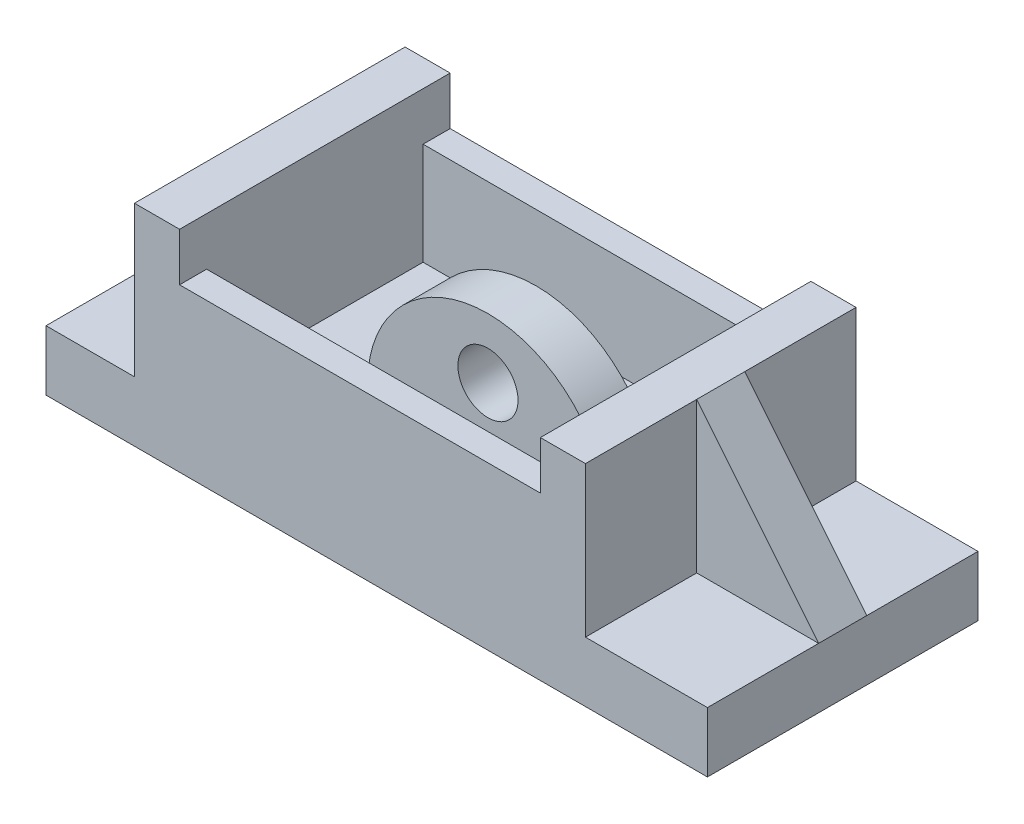
ISO-10303-21;
HEADER;
FILE_DESCRIPTION(('STEP AP214'),'2;1');
FILE_NAME('part.step','',(''),(''),'','','');
FILE_SCHEMA(('AUTOMOTIVE_DESIGN { 1 0 10303 214 1 1 1 1 }'));
ENDSEC;
DATA;
#1=APPLICATION_CONTEXT('core data for automotive mechanical design processes');
#2=APPLICATION_PROTOCOL_DEFINITION('international standard','automotive_design',2000,#1);
#3=PRODUCT_CONTEXT('',#1,'mechanical');
#4=PRODUCT('Part','Part','',(#3));
#5=PRODUCT_RELATED_PRODUCT_CATEGORY('part','',(#4));
#6=PRODUCT_DEFINITION_FORMATION('','',#4);
#7=PRODUCT_DEFINITION_CONTEXT('part definition',#1,'design');
#8=PRODUCT_DEFINITION('design','',#6,#7);
#9=PRODUCT_DEFINITION_SHAPE('','',#8);
#10=(LENGTH_UNIT() NAMED_UNIT(*) SI_UNIT(.MILLI.,.METRE.));
#11=(NAMED_UNIT(*) PLANE_ANGLE_UNIT() SI_UNIT($,.RADIAN.));
#12=(NAMED_UNIT(*) SI_UNIT($,.STERADIAN.) SOLID_ANGLE_UNIT());
#13=UNCERTAINTY_MEASURE_WITH_UNIT(LENGTH_MEASURE(1.E-05),#10,'distance_accuracy_value','');
#14=(GEOMETRIC_REPRESENTATION_CONTEXT(3) GLOBAL_UNCERTAINTY_ASSIGNED_CONTEXT((#13)) GLOBAL_UNIT_ASSIGNED_CONTEXT((#10,
#11,#12)) REPRESENTATION_CONTEXT('',''));
#15=CARTESIAN_POINT('',(0.,0.,0.));
#16=DIRECTION('',(0.,0.,1.));
#17=DIRECTION('',(1.,0.,0.));
#18=AXIS2_PLACEMENT_3D('',#15,#16,#17);
#19=CARTESIAN_POINT('',(34.7153700189753,35.,0.));
#20=DIRECTION('',(1.,0.,0.));
#21=DIRECTION('',(0.,0.,-1.));
#22=AXIS2_PLACEMENT_3D('',#19,#20,#21);
#23=PLANE('',#22);
#24=DIRECTION('',(0.,0.,1.));
#25=VECTOR('',#24,1.);
#26=CARTESIAN_POINT('',(34.7153700189753,35.,0.));
#27=LINE('',#26,#25);
#28=CARTESIAN_POINT('',(34.7153700189753,35.,-22.5));
#29=VERTEX_POINT('',#28);
#30=CARTESIAN_POINT('',(34.7153700189753,35.,-4.));
#31=VERTEX_POINT('',#30);
#32=EDGE_CURVE('E224',#29,#31,#27,.T.);
#33=ORIENTED_EDGE('',*,*,#32,.T.);
#34=DIRECTION('',(0.,-1.,0.));
#35=VECTOR('',#34,1.);
#36=CARTESIAN_POINT('',(34.7153700189753,35.,-4.));
#37=LINE('',#36,#35);
#38=CARTESIAN_POINT('',(34.7153700189753,10.,-4.));
#39=VERTEX_POINT('',#38);
#40=EDGE_CURVE('E198',#31,#39,#37,.T.);
#41=ORIENTED_EDGE('',*,*,#40,.T.);
#42=DIRECTION('',(0.,0.,1.));
#43=VECTOR('',#42,1.);
#44=CARTESIAN_POINT('',(34.7153700189753,10.,0.));
#45=LINE('',#44,#43);
#46=CARTESIAN_POINT('',(34.7153700189753,10.,-22.5));
#47=VERTEX_POINT('',#46);
#48=EDGE_CURVE('E483',#47,#39,#45,.T.);
#49=ORIENTED_EDGE('',*,*,#48,.F.);
#50=DIRECTION('',(0.,-1.,0.));
#51=VECTOR('',#50,1.);
#52=CARTESIAN_POINT('',(34.7153700189753,35.,-22.5));
#53=LINE('',#52,#51);
#54=EDGE_CURVE('E232',#29,#47,#53,.T.);
#55=ORIENTED_EDGE('',*,*,#54,.F.);
#56=EDGE_LOOP('',(#33,#41,#49,#55));
#57=FACE_BOUND('',#56,.T.);
#58=ADVANCED_FACE('F39',(#57),#23,.T.);
#59=CARTESIAN_POINT('',(0.,10.,0.));
#60=DIRECTION('',(0.,1.,0.));
#61=DIRECTION('',(0.,0.,1.));
#62=AXIS2_PLACEMENT_3D('',#59,#60,#61);
#63=PLANE('',#62);
#64=ORIENTED_EDGE('',*,*,#48,.T.);
#65=DIRECTION('',(1.,0.,0.));
#66=VECTOR('',#65,1.);
#67=CARTESIAN_POINT('',(0.,10.,-4.));
#68=LINE('',#67,#66);
#69=CARTESIAN_POINT('',(55.,10.,-4.));
#70=VERTEX_POINT('',#69);
#71=EDGE_CURVE('E201',#39,#70,#68,.T.);
#72=ORIENTED_EDGE('',*,*,#71,.T.);
#73=DIRECTION('',(0.,0.,-1.));
#74=VECTOR('',#73,1.);
#75=CARTESIAN_POINT('',(55.,10.,0.));
#76=LINE('',#75,#74);
#77=CARTESIAN_POINT('',(55.,10.,-22.5));
#78=VERTEX_POINT('',#77);
#79=EDGE_CURVE('E488',#70,#78,#76,.T.);
#80=ORIENTED_EDGE('',*,*,#79,.T.);
#81=DIRECTION('',(-1.,0.,0.));
#82=VECTOR('',#81,1.);
#83=CARTESIAN_POINT('',(0.,10.,-22.5));
#84=LINE('',#83,#82);
#85=EDGE_CURVE('E479',#78,#47,#84,.T.);
#86=ORIENTED_EDGE('',*,*,#85,.T.);
#87=EDGE_LOOP('',(#64,#72,#80,#86));
#88=FACE_BOUND('',#87,.T.);
#89=ADVANCED_FACE('F496',(#88),#63,.T.);
#90=CARTESIAN_POINT('',(0.,10.,0.));
#91=DIRECTION('',(0.,1.,0.));
#92=DIRECTION('',(0.,0.,1.));
#93=AXIS2_PLACEMENT_3D('',#90,#91,#92);
#94=PLANE('',#93);
#95=DIRECTION('',(0.,0.,-1.));
#96=VECTOR('',#95,1.);
#97=CARTESIAN_POINT('',(-55.,10.,0.));
#98=LINE('',#97,#96);
#99=CARTESIAN_POINT('',(-55.,10.,-4.));
#100=VERTEX_POINT('',#99);
#101=CARTESIAN_POINT('',(-55.,10.,-22.5));
#102=VERTEX_POINT('',#101);
#103=EDGE_CURVE('E306',#100,#102,#98,.T.);
#104=ORIENTED_EDGE('',*,*,#103,.F.);
#105=DIRECTION('',(1.,0.,0.));
#106=VECTOR('',#105,1.);
#107=CARTESIAN_POINT('',(0.,10.,-4.));
#108=LINE('',#107,#106);
#109=CARTESIAN_POINT('',(-40.2846299810247,10.,-4.));
#110=VERTEX_POINT('',#109);
#111=EDGE_CURVE('E388',#100,#110,#108,.T.);
#112=ORIENTED_EDGE('',*,*,#111,.T.);
#113=DIRECTION('',(0.,0.,1.));
#114=VECTOR('',#113,1.);
#115=CARTESIAN_POINT('',(-40.2846299810247,10.,0.));
#116=LINE('',#115,#114);
#117=CARTESIAN_POINT('',(-40.2846299810247,10.,-22.5));
#118=VERTEX_POINT('',#117);
#119=EDGE_CURVE('E311',#118,#110,#116,.T.);
#120=ORIENTED_EDGE('',*,*,#119,.F.);
#121=DIRECTION('',(-1.,0.,0.));
#122=VECTOR('',#121,1.);
#123=CARTESIAN_POINT('',(0.,10.,-22.5));
#124=LINE('',#123,#122);
#125=EDGE_CURVE('E315',#118,#102,#124,.T.);
#126=ORIENTED_EDGE('',*,*,#125,.T.);
#127=EDGE_LOOP('',(#104,#112,#120,#126));
#128=FACE_BOUND('',#127,.T.);
#129=ADVANCED_FACE('F550',(#128),#94,.T.);
#130=CARTESIAN_POINT('',(-40.2846299810247,35.,0.));
#131=DIRECTION('',(1.,0.,0.));
#132=DIRECTION('',(0.,0.,-1.));
#133=AXIS2_PLACEMENT_3D('',#130,#131,#132);
#134=PLANE('',#133);
#135=DIRECTION('',(0.,-1.,0.));
#136=VECTOR('',#135,1.);
#137=CARTESIAN_POINT('',(-40.2846299810247,35.,-4.));
#138=LINE('',#137,#136);
#139=CARTESIAN_POINT('',(-40.2846299810247,35.,-4.));
#140=VERTEX_POINT('',#139);
#141=EDGE_CURVE('E395',#140,#110,#138,.T.);
#142=ORIENTED_EDGE('',*,*,#141,.F.);
#143=DIRECTION('',(0.,0.,1.));
#144=VECTOR('',#143,1.);
#145=CARTESIAN_POINT('',(-40.2846299810247,35.,0.));
#146=LINE('',#145,#144);
#147=CARTESIAN_POINT('',(-40.2846299810247,35.,-22.5));
#148=VERTEX_POINT('',#147);
#149=EDGE_CURVE('E275',#148,#140,#146,.T.);
#150=ORIENTED_EDGE('',*,*,#149,.F.);
#151=DIRECTION('',(0.,-1.,0.));
#152=VECTOR('',#151,1.);
#153=CARTESIAN_POINT('',(-40.2846299810247,35.,-22.5));
#154=LINE('',#153,#152);
#155=EDGE_CURVE('E292',#148,#118,#154,.T.);
#156=ORIENTED_EDGE('',*,*,#155,.T.);
#157=ORIENTED_EDGE('',*,*,#119,.T.);
#158=EDGE_LOOP('',(#142,#150,#156,#157));
#159=FACE_BOUND('',#158,.T.);
#160=ADVANCED_FACE('F565',(#159),#134,.F.);
#161=CARTESIAN_POINT('',(0.,10.,0.));
#162=DIRECTION('',(0.,1.,0.));
#163=DIRECTION('',(0.,0.,1.));
#164=AXIS2_PLACEMENT_3D('',#161,#162,#163);
#165=PLANE('',#164);
#166=DIRECTION('',(1.,0.,0.));
#167=VECTOR('',#166,1.);
#168=CARTESIAN_POINT('',(-20.,10.,4.));
#169=LINE('',#168,#167);
#170=CARTESIAN_POINT('',(-20.,10.,4.));
#171=VERTEX_POINT('',#170);
#172=CARTESIAN_POINT('',(20.,10.,4.));
#173=VERTEX_POINT('',#172);
#174=EDGE_CURVE('E420',#171,#173,#169,.T.);
#175=ORIENTED_EDGE('',*,*,#174,.F.);
#176=DIRECTION('',(0.,0.,-1.));
#177=VECTOR('',#176,1.);
#178=CARTESIAN_POINT('',(-20.,10.,4.));
#179=LINE('',#178,#177);
#180=CARTESIAN_POINT('',(-20.,10.,-4.));
#181=VERTEX_POINT('',#180);
#182=EDGE_CURVE('E432',#171,#181,#179,.T.);
#183=ORIENTED_EDGE('',*,*,#182,.T.);
#184=DIRECTION('',(1.,0.,0.));
#185=VECTOR('',#184,1.);
#186=CARTESIAN_POINT('',(-20.,10.,-4.));
#187=LINE('',#186,#185);
#188=CARTESIAN_POINT('',(20.,10.,-4.));
#189=VERTEX_POINT('',#188);
#190=EDGE_CURVE('E421',#181,#189,#187,.T.);
#191=ORIENTED_EDGE('',*,*,#190,.T.);
#192=DIRECTION('',(0.,0.,-1.));
#193=VECTOR('',#192,1.);
#194=CARTESIAN_POINT('',(20.,10.,4.));
#195=LINE('',#194,#193);
#196=EDGE_CURVE('E424',#173,#189,#195,.T.);
#197=ORIENTED_EDGE('',*,*,#196,.F.);
#198=EDGE_LOOP('',(#175,#183,#191,#197));
#199=FACE_BOUND('',#198,.T.);
#200=DIRECTION('',(0.,0.,1.));
#201=VECTOR('',#200,1.);
#202=CARTESIAN_POINT('',(-32.7846299810247,10.,0.));
#203=LINE('',#202,#201);
#204=CARTESIAN_POINT('',(-32.7846299810247,10.,-18.));
#205=VERTEX_POINT('',#204);
#206=CARTESIAN_POINT('',(-32.7846299810247,10.,18.));
#207=VERTEX_POINT('',#206);
#208=EDGE_CURVE('E254',#205,#207,#203,.T.);
#209=ORIENTED_EDGE('',*,*,#208,.T.);
#210=DIRECTION('',(1.,0.,0.));
#211=VECTOR('',#210,1.);
#212=CARTESIAN_POINT('',(0.,10.,18.));
#213=LINE('',#212,#211);
#214=CARTESIAN_POINT('',(27.2153700189753,10.,18.));
#215=VERTEX_POINT('',#214);
#216=EDGE_CURVE('E257',#207,#215,#213,.T.);
#217=ORIENTED_EDGE('',*,*,#216,.T.);
#218=DIRECTION('',(0.,0.,1.));
#219=VECTOR('',#218,1.);
#220=CARTESIAN_POINT('',(27.2153700189753,10.,0.));
#221=LINE('',#220,#219);
#222=CARTESIAN_POINT('',(27.2153700189753,10.,-18.));
#223=VERTEX_POINT('',#222);
#224=EDGE_CURVE('E261',#223,#215,#221,.T.);
#225=ORIENTED_EDGE('',*,*,#224,.F.);
#226=DIRECTION('',(1.,0.,0.));
#227=VECTOR('',#226,1.);
#228=CARTESIAN_POINT('',(0.,10.,-18.));
#229=LINE('',#228,#227);
#230=EDGE_CURVE('E264',#205,#223,#229,.T.);
#231=ORIENTED_EDGE('',*,*,#230,.F.);
#232=EDGE_LOOP('',(#209,#217,#225,#231));
#233=FACE_BOUND('',#232,.T.);
#234=ADVANCED_FACE('F567',(#199,#233),#165,.T.);
#235=CARTESIAN_POINT('',(-32.7846299810247,35.,0.));
#236=DIRECTION('',(1.,0.,0.));
#237=DIRECTION('',(0.,0.,-1.));
#238=AXIS2_PLACEMENT_3D('',#235,#236,#237);
#239=PLANE('',#238);
#240=DIRECTION('',(0.,-1.,0.));
#241=VECTOR('',#240,1.);
#242=CARTESIAN_POINT('',(-32.7846299810247,27.,18.));
#243=LINE('',#242,#241);
#244=CARTESIAN_POINT('',(-32.7846299810247,27.,18.));
#245=VERTEX_POINT('',#244);
#246=EDGE_CURVE('E475',#245,#207,#243,.T.);
#247=ORIENTED_EDGE('',*,*,#246,.T.);
#248=ORIENTED_EDGE('',*,*,#208,.F.);
#249=DIRECTION('',(0.,-1.,0.));
#250=VECTOR('',#249,1.);
#251=CARTESIAN_POINT('',(-32.7846299810247,27.,-18.));
#252=LINE('',#251,#250);
#253=CARTESIAN_POINT('',(-32.7846299810247,27.,-18.));
#254=VERTEX_POINT('',#253);
#255=EDGE_CURVE('E454',#254,#205,#252,.T.);
#256=ORIENTED_EDGE('',*,*,#255,.F.);
#257=DIRECTION('',(0.,0.,1.));
#258=VECTOR('',#257,1.);
#259=CARTESIAN_POINT('',(-32.7846299810247,27.,0.));
#260=LINE('',#259,#258);
#261=CARTESIAN_POINT('',(-32.7846299810247,27.,-22.5));
#262=VERTEX_POINT('',#261);
#263=EDGE_CURVE('E436',#262,#254,#260,.T.);
#264=ORIENTED_EDGE('',*,*,#263,.F.);
#265=DIRECTION('',(0.,-1.,0.));
#266=VECTOR('',#265,1.);
#267=CARTESIAN_POINT('',(-32.7846299810247,35.,-22.5));
#268=LINE('',#267,#266);
#269=CARTESIAN_POINT('',(-32.7846299810247,35.,-22.5));
#270=VERTEX_POINT('',#269);
#271=EDGE_CURVE('E296',#270,#262,#268,.T.);
#272=ORIENTED_EDGE('',*,*,#271,.F.);
#273=DIRECTION('',(0.,0.,1.));
#274=VECTOR('',#273,1.);
#275=CARTESIAN_POINT('',(-32.7846299810247,35.,0.));
#276=LINE('',#275,#274);
#277=CARTESIAN_POINT('',(-32.7846299810247,35.,22.5));
#278=VERTEX_POINT('',#277);
#279=EDGE_CURVE('E268',#270,#278,#276,.T.);
#280=ORIENTED_EDGE('',*,*,#279,.T.);
#281=DIRECTION('',(0.,-1.,0.));
#282=VECTOR('',#281,1.);
#283=CARTESIAN_POINT('',(-32.7846299810247,35.,22.5));
#284=LINE('',#283,#282);
#285=CARTESIAN_POINT('',(-32.7846299810247,27.,22.5));
#286=VERTEX_POINT('',#285);
#287=EDGE_CURVE('E284',#278,#286,#284,.T.);
#288=ORIENTED_EDGE('',*,*,#287,.T.);
#289=DIRECTION('',(0.,0.,1.));
#290=VECTOR('',#289,1.);
#291=CARTESIAN_POINT('',(-32.7846299810247,27.,0.));
#292=LINE('',#291,#290);
#293=EDGE_CURVE('E461',#245,#286,#292,.T.);
#294=ORIENTED_EDGE('',*,*,#293,.F.);
#295=EDGE_LOOP('',(#247,#248,#256,#264,#272,#280,#288,#294));
#296=FACE_BOUND('',#295,.T.);
#297=ADVANCED_FACE('F511',(#296),#239,.T.);
#298=CARTESIAN_POINT('',(27.2153700189753,35.,0.));
#299=DIRECTION('',(1.,0.,0.));
#300=DIRECTION('',(0.,0.,-1.));
#301=AXIS2_PLACEMENT_3D('',#298,#299,#300);
#302=PLANE('',#301);
#303=DIRECTION('',(0.,-1.,0.));
#304=VECTOR('',#303,1.);
#305=CARTESIAN_POINT('',(27.2153700189753,35.,22.5));
#306=LINE('',#305,#304);
#307=CARTESIAN_POINT('',(27.2153700189753,35.,22.5));
#308=VERTEX_POINT('',#307);
#309=CARTESIAN_POINT('',(27.2153700189753,27.,22.5));
#310=VERTEX_POINT('',#309);
#311=EDGE_CURVE('E247',#308,#310,#306,.T.);
#312=ORIENTED_EDGE('',*,*,#311,.F.);
#313=DIRECTION('',(0.,0.,1.));
#314=VECTOR('',#313,1.);
#315=CARTESIAN_POINT('',(27.2153700189753,35.,0.));
#316=LINE('',#315,#314);
#317=CARTESIAN_POINT('',(27.2153700189753,35.,-22.5));
#318=VERTEX_POINT('',#317);
#319=EDGE_CURVE('E362',#318,#308,#316,.T.);
#320=ORIENTED_EDGE('',*,*,#319,.F.);
#321=DIRECTION('',(0.,-1.,0.));
#322=VECTOR('',#321,1.);
#323=CARTESIAN_POINT('',(27.2153700189753,35.,-22.5));
#324=LINE('',#323,#322);
#325=CARTESIAN_POINT('',(27.2153700189753,27.,-22.5));
#326=VERTEX_POINT('',#325);
#327=EDGE_CURVE('E251',#318,#326,#324,.T.);
#328=ORIENTED_EDGE('',*,*,#327,.T.);
#329=DIRECTION('',(0.,0.,1.));
#330=VECTOR('',#329,1.);
#331=CARTESIAN_POINT('',(27.2153700189753,27.,0.));
#332=LINE('',#331,#330);
#333=CARTESIAN_POINT('',(27.2153700189753,27.,-18.));
#334=VERTEX_POINT('',#333);
#335=EDGE_CURVE('E444',#326,#334,#332,.T.);
#336=ORIENTED_EDGE('',*,*,#335,.T.);
#337=DIRECTION('',(0.,-1.,0.));
#338=VECTOR('',#337,1.);
#339=CARTESIAN_POINT('',(27.2153700189753,27.,-18.));
#340=LINE('',#339,#338);
#341=EDGE_CURVE('E451',#334,#223,#340,.T.);
#342=ORIENTED_EDGE('',*,*,#341,.T.);
#343=ORIENTED_EDGE('',*,*,#224,.T.);
#344=DIRECTION('',(0.,-1.,0.));
#345=VECTOR('',#344,1.);
#346=CARTESIAN_POINT('',(27.2153700189753,27.,18.));
#347=LINE('',#346,#345);
#348=CARTESIAN_POINT('',(27.2153700189753,27.,18.));
#349=VERTEX_POINT('',#348);
#350=EDGE_CURVE('E471',#349,#215,#347,.T.);
#351=ORIENTED_EDGE('',*,*,#350,.F.);
#352=DIRECTION('',(0.,0.,1.));
#353=VECTOR('',#352,1.);
#354=CARTESIAN_POINT('',(27.2153700189753,27.,0.));
#355=LINE('',#354,#353);
#356=EDGE_CURVE('E467',#349,#310,#355,.T.);
#357=ORIENTED_EDGE('',*,*,#356,.T.);
#358=EDGE_LOOP('',(#312,#320,#328,#336,#342,#343,#351,#357));
#359=FACE_BOUND('',#358,.T.);
#360=ADVANCED_FACE('F501',(#359),#302,.F.);
#361=CARTESIAN_POINT('',(-55.,10.,0.));
#362=DIRECTION('',(-1.,0.,0.));
#363=DIRECTION('',(0.,0.,1.));
#364=AXIS2_PLACEMENT_3D('',#361,#362,#363);
#365=PLANE('',#364);
#366=CARTESIAN_POINT('',(-55.,10.,22.5));
#367=VERTEX_POINT('',#366);
#368=CARTESIAN_POINT('',(-55.,10.,4.));
#369=VERTEX_POINT('',#368);
#370=EDGE_CURVE('E301',#367,#369,#98,.T.);
#371=ORIENTED_EDGE('',*,*,#370,.T.);
#372=DIRECTION('',(0.,0.,1.));
#373=VECTOR('',#372,1.);
#374=CARTESIAN_POINT('',(-55.,10.,0.));
#375=LINE('',#374,#373);
#376=EDGE_CURVE('E405',#100,#369,#375,.T.);
#377=ORIENTED_EDGE('',*,*,#376,.F.);
#378=ORIENTED_EDGE('',*,*,#103,.T.);
#379=DIRECTION('',(0.,-1.,0.));
#380=VECTOR('',#379,1.);
#381=CARTESIAN_POINT('',(-55.,10.,-22.5));
#382=LINE('',#381,#380);
#383=CARTESIAN_POINT('',(-55.,0.,-22.5));
#384=VERTEX_POINT('',#383);
#385=EDGE_CURVE('E48',#102,#384,#382,.T.);
#386=ORIENTED_EDGE('',*,*,#385,.T.);
#387=DIRECTION('',(0.,0.,-1.));
#388=VECTOR('',#387,1.);
#389=CARTESIAN_POINT('',(-55.,0.,0.));
#390=LINE('',#389,#388);
#391=CARTESIAN_POINT('',(-55.,0.,22.5));
#392=VERTEX_POINT('',#391);
#393=EDGE_CURVE('E300',#392,#384,#390,.T.);
#394=ORIENTED_EDGE('',*,*,#393,.F.);
#395=DIRECTION('',(0.,-1.,0.));
#396=VECTOR('',#395,1.);
#397=CARTESIAN_POINT('',(-55.,10.,22.5));
#398=LINE('',#397,#396);
#399=EDGE_CURVE('E11',#367,#392,#398,.T.);
#400=ORIENTED_EDGE('',*,*,#399,.F.);
#401=EDGE_LOOP('',(#371,#377,#378,#386,#394,#400));
#402=FACE_BOUND('',#401,.T.);
#403=ADVANCED_FACE('F41',(#402),#365,.T.);
#404=CARTESIAN_POINT('',(0.,10.,22.5));
#405=DIRECTION('',(0.,0.,1.));
#406=DIRECTION('',(1.,0.,0.));
#407=AXIS2_PLACEMENT_3D('',#404,#405,#406);
#408=PLANE('',#407);
#409=DIRECTION('',(-1.,0.,0.));
#410=VECTOR('',#409,1.);
#411=CARTESIAN_POINT('',(0.,0.,22.5));
#412=LINE('',#411,#410);
#413=CARTESIAN_POINT('',(55.,0.,22.5));
#414=VERTEX_POINT('',#413);
#415=EDGE_CURVE('E321',#414,#392,#412,.T.);
#416=ORIENTED_EDGE('',*,*,#415,.F.);
#417=DIRECTION('',(0.,-1.,0.));
#418=VECTOR('',#417,1.);
#419=CARTESIAN_POINT('',(55.,10.,22.5));
#420=LINE('',#419,#418);
#421=CARTESIAN_POINT('',(55.,10.,22.5));
#422=VERTEX_POINT('',#421);
#423=EDGE_CURVE('E350',#422,#414,#420,.T.);
#424=ORIENTED_EDGE('',*,*,#423,.F.);
#425=DIRECTION('',(-1.,0.,0.));
#426=VECTOR('',#425,1.);
#427=CARTESIAN_POINT('',(0.,10.,22.5));
#428=LINE('',#427,#426);
#429=CARTESIAN_POINT('',(34.7153700189753,10.,22.5));
#430=VERTEX_POINT('',#429);
#431=EDGE_CURVE('E372',#422,#430,#428,.T.);
#432=ORIENTED_EDGE('',*,*,#431,.T.);
#433=DIRECTION('',(0.,-1.,0.));
#434=VECTOR('',#433,1.);
#435=CARTESIAN_POINT('',(34.7153700189753,35.,22.5));
#436=LINE('',#435,#434);
#437=CARTESIAN_POINT('',(34.7153700189753,35.,22.5));
#438=VERTEX_POINT('',#437);
#439=EDGE_CURVE('E238',#438,#430,#436,.T.);
#440=ORIENTED_EDGE('',*,*,#439,.F.);
#441=DIRECTION('',(-1.,0.,0.));
#442=VECTOR('',#441,1.);
#443=CARTESIAN_POINT('',(0.,35.,22.5));
#444=LINE('',#443,#442);
#445=EDGE_CURVE('E240',#438,#308,#444,.T.);
#446=ORIENTED_EDGE('',*,*,#445,.T.);
#447=ORIENTED_EDGE('',*,*,#311,.T.);
#448=DIRECTION('',(-1.,0.,0.));
#449=VECTOR('',#448,1.);
#450=CARTESIAN_POINT('',(0.,27.,22.5));
#451=LINE('',#450,#449);
#452=EDGE_CURVE('E464',#310,#286,#451,.T.);
#453=ORIENTED_EDGE('',*,*,#452,.T.);
#454=ORIENTED_EDGE('',*,*,#287,.F.);
#455=DIRECTION('',(-1.,0.,0.));
#456=VECTOR('',#455,1.);
#457=CARTESIAN_POINT('',(0.,35.,22.5));
#458=LINE('',#457,#456);
#459=CARTESIAN_POINT('',(-40.2846299810247,35.,22.5));
#460=VERTEX_POINT('',#459);
#461=EDGE_CURVE('E279',#278,#460,#458,.T.);
#462=ORIENTED_EDGE('',*,*,#461,.T.);
#463=DIRECTION('',(0.,-1.,0.));
#464=VECTOR('',#463,1.);
#465=CARTESIAN_POINT('',(-40.2846299810247,35.,22.5));
#466=LINE('',#465,#464);
#467=CARTESIAN_POINT('',(-40.2846299810247,10.,22.5));
#468=VERTEX_POINT('',#467);
#469=EDGE_CURVE('E288',#460,#468,#466,.T.);
#470=ORIENTED_EDGE('',*,*,#469,.T.);
#471=DIRECTION('',(-1.,0.,0.));
#472=VECTOR('',#471,1.);
#473=CARTESIAN_POINT('',(0.,10.,22.5));
#474=LINE('',#473,#472);
#475=EDGE_CURVE('E305',#468,#367,#474,.T.);
#476=ORIENTED_EDGE('',*,*,#475,.T.);
#477=ORIENTED_EDGE('',*,*,#399,.T.);
#478=EDGE_LOOP('',(#416,#424,#432,#440,#446,#447,#453,#454,#462,#470,#476,#477));
#479=FACE_BOUND('',#478,.T.);
#480=ADVANCED_FACE('F348',(#479),#408,.T.);
#481=CARTESIAN_POINT('',(0.,10.,-22.5));
#482=DIRECTION('',(0.,0.,1.));
#483=DIRECTION('',(1.,0.,0.));
#484=AXIS2_PLACEMENT_3D('',#481,#482,#483);
#485=PLANE('',#484);
#486=DIRECTION('',(-1.,0.,0.));
#487=VECTOR('',#486,1.);
#488=CARTESIAN_POINT('',(0.,0.,-22.5));
#489=LINE('',#488,#487);
#490=CARTESIAN_POINT('',(55.,0.,-22.5));
#491=VERTEX_POINT('',#490);
#492=EDGE_CURVE('E325',#491,#384,#489,.T.);
#493=ORIENTED_EDGE('',*,*,#492,.T.);
#494=ORIENTED_EDGE('',*,*,#385,.F.);
#495=ORIENTED_EDGE('',*,*,#125,.F.);
#496=ORIENTED_EDGE('',*,*,#155,.F.);
#497=DIRECTION('',(-1.,0.,0.));
#498=VECTOR('',#497,1.);
#499=CARTESIAN_POINT('',(0.,35.,-22.5));
#500=LINE('',#499,#498);
#501=EDGE_CURVE('E271',#270,#148,#500,.T.);
#502=ORIENTED_EDGE('',*,*,#501,.F.);
#503=ORIENTED_EDGE('',*,*,#271,.T.);
#504=DIRECTION('',(-1.,0.,0.));
#505=VECTOR('',#504,1.);
#506=CARTESIAN_POINT('',(0.,27.,-22.5));
#507=LINE('',#506,#505);
#508=EDGE_CURVE('E447',#326,#262,#507,.T.);
#509=ORIENTED_EDGE('',*,*,#508,.F.);
#510=ORIENTED_EDGE('',*,*,#327,.F.);
#511=DIRECTION('',(-1.,0.,0.));
#512=VECTOR('',#511,1.);
#513=CARTESIAN_POINT('',(0.,35.,-22.5));
#514=LINE('',#513,#512);
#515=EDGE_CURVE('E358',#29,#318,#514,.T.);
#516=ORIENTED_EDGE('',*,*,#515,.F.);
#517=ORIENTED_EDGE('',*,*,#54,.T.);
#518=ORIENTED_EDGE('',*,*,#85,.F.);
#519=DIRECTION('',(0.,-1.,0.));
#520=VECTOR('',#519,1.);
#521=CARTESIAN_POINT('',(55.,10.,-22.5));
#522=LINE('',#521,#520);
#523=EDGE_CURVE('E341',#78,#491,#522,.T.);
#524=ORIENTED_EDGE('',*,*,#523,.T.);
#525=EDGE_LOOP('',(#493,#494,#495,#496,#502,#503,#509,#510,#516,#517,#518,#524));
#526=FACE_BOUND('',#525,.T.);
#527=ADVANCED_FACE('F338',(#526),#485,.F.);
#528=DIRECTION('',(1.,0.,0.));
#529=VECTOR('',#528,1.);
#530=CARTESIAN_POINT('',(0.,10.,4.));
#531=LINE('',#530,#529);
#532=CARTESIAN_POINT('',(-40.2846299810247,10.,4.));
#533=VERTEX_POINT('',#532);
#534=EDGE_CURVE('E398',#369,#533,#531,.T.);
#535=ORIENTED_EDGE('',*,*,#534,.F.);
#536=ORIENTED_EDGE('',*,*,#370,.F.);
#537=ORIENTED_EDGE('',*,*,#475,.F.);
#538=EDGE_CURVE('E310',#533,#468,#116,.T.);
#539=ORIENTED_EDGE('',*,*,#538,.F.);
#540=EDGE_LOOP('',(#535,#536,#537,#539));
#541=FACE_BOUND('',#540,.T.);
#542=ADVANCED_FACE('F528',(#541),#94,.T.);
#543=CARTESIAN_POINT('',(0.,0.,0.));
#544=DIRECTION('',(0.,1.,0.));
#545=DIRECTION('',(0.,0.,1.));
#546=AXIS2_PLACEMENT_3D('',#543,#544,#545);
#547=PLANE('',#546);
#548=ORIENTED_EDGE('',*,*,#393,.T.);
#549=ORIENTED_EDGE('',*,*,#492,.F.);
#550=DIRECTION('',(0.,0.,-1.));
#551=VECTOR('',#550,1.);
#552=CARTESIAN_POINT('',(55.,0.,0.));
#553=LINE('',#552,#551);
#554=EDGE_CURVE('E345',#414,#491,#553,.T.);
#555=ORIENTED_EDGE('',*,*,#554,.F.);
#556=ORIENTED_EDGE('',*,*,#415,.T.);
#557=EDGE_LOOP('',(#548,#549,#555,#556));
#558=FACE_BOUND('',#557,.T.);
#559=ADVANCED_FACE('F344',(#558),#547,.F.);
#560=CARTESIAN_POINT('',(-40.2846299810247,35.,4.));
#561=VERTEX_POINT('',#560);
#562=EDGE_CURVE('E274',#561,#460,#146,.T.);
#563=ORIENTED_EDGE('',*,*,#562,.F.);
#564=DIRECTION('',(0.,-1.,0.));
#565=VECTOR('',#564,1.);
#566=CARTESIAN_POINT('',(-40.2846299810247,35.,4.));
#567=LINE('',#566,#565);
#568=EDGE_CURVE('E401',#561,#533,#567,.T.);
#569=ORIENTED_EDGE('',*,*,#568,.T.);
#570=ORIENTED_EDGE('',*,*,#538,.T.);
#571=ORIENTED_EDGE('',*,*,#469,.F.);
#572=EDGE_LOOP('',(#563,#569,#570,#571));
#573=FACE_BOUND('',#572,.T.);
#574=ADVANCED_FACE('F522',(#573),#134,.F.);
#575=CARTESIAN_POINT('',(0.,35.,0.));
#576=DIRECTION('',(0.,1.,0.));
#577=DIRECTION('',(0.,0.,1.));
#578=AXIS2_PLACEMENT_3D('',#575,#576,#577);
#579=PLANE('',#578);
#580=ORIENTED_EDGE('',*,*,#461,.F.);
#581=ORIENTED_EDGE('',*,*,#279,.F.);
#582=ORIENTED_EDGE('',*,*,#501,.T.);
#583=ORIENTED_EDGE('',*,*,#149,.T.);
#584=EDGE_CURVE('E280',#140,#561,#146,.T.);
#585=ORIENTED_EDGE('',*,*,#584,.T.);
#586=ORIENTED_EDGE('',*,*,#562,.T.);
#587=EDGE_LOOP('',(#580,#581,#582,#583,#585,#586));
#588=FACE_BOUND('',#587,.T.);
#589=ADVANCED_FACE('F515',(#588),#579,.T.);
#590=DIRECTION('',(0.,-1.,0.));
#591=VECTOR('',#590,1.);
#592=CARTESIAN_POINT('',(34.7153700189753,35.,4.));
#593=LINE('',#592,#591);
#594=CARTESIAN_POINT('',(34.7153700189753,35.,4.));
#595=VERTEX_POINT('',#594);
#596=CARTESIAN_POINT('',(34.7153700189753,10.,4.));
#597=VERTEX_POINT('',#596);
#598=EDGE_CURVE('E206',#595,#597,#593,.T.);
#599=ORIENTED_EDGE('',*,*,#598,.F.);
#600=EDGE_CURVE('E226',#595,#438,#27,.T.);
#601=ORIENTED_EDGE('',*,*,#600,.T.);
#602=ORIENTED_EDGE('',*,*,#439,.T.);
#603=EDGE_CURVE('E377',#597,#430,#45,.T.);
#604=ORIENTED_EDGE('',*,*,#603,.F.);
#605=EDGE_LOOP('',(#599,#601,#602,#604));
#606=FACE_BOUND('',#605,.T.);
#607=ADVANCED_FACE('F376',(#606),#23,.T.);
#608=CARTESIAN_POINT('',(0.,35.,0.));
#609=DIRECTION('',(0.,1.,0.));
#610=DIRECTION('',(0.,0.,1.));
#611=AXIS2_PLACEMENT_3D('',#608,#609,#610);
#612=PLANE('',#611);
#613=ORIENTED_EDGE('',*,*,#600,.F.);
#614=DIRECTION('',(0.,0.,1.));
#615=VECTOR('',#614,1.);
#616=CARTESIAN_POINT('',(34.7153700189753,35.,0.));
#617=LINE('',#616,#615);
#618=EDGE_CURVE('E212',#595,#31,#617,.F.);
#619=ORIENTED_EDGE('',*,*,#618,.T.);
#620=ORIENTED_EDGE('',*,*,#32,.F.);
#621=ORIENTED_EDGE('',*,*,#515,.T.);
#622=ORIENTED_EDGE('',*,*,#319,.T.);
#623=ORIENTED_EDGE('',*,*,#445,.F.);
#624=EDGE_LOOP('',(#613,#619,#620,#621,#622,#623));
#625=FACE_BOUND('',#624,.T.);
#626=ADVANCED_FACE('F222',(#625),#612,.T.);
#627=CARTESIAN_POINT('',(55.,10.,0.));
#628=DIRECTION('',(-1.,0.,0.));
#629=DIRECTION('',(0.,0.,1.));
#630=AXIS2_PLACEMENT_3D('',#627,#628,#629);
#631=PLANE('',#630);
#632=ORIENTED_EDGE('',*,*,#554,.T.);
#633=ORIENTED_EDGE('',*,*,#523,.F.);
#634=ORIENTED_EDGE('',*,*,#79,.F.);
#635=CARTESIAN_POINT('',(55.,10.,4.));
#636=VERTEX_POINT('',#635);
#637=EDGE_CURVE('E215',#636,#70,#76,.T.);
#638=ORIENTED_EDGE('',*,*,#637,.F.);
#639=EDGE_CURVE('E355',#422,#636,#76,.T.);
#640=ORIENTED_EDGE('',*,*,#639,.F.);
#641=ORIENTED_EDGE('',*,*,#423,.T.);
#642=EDGE_LOOP('',(#632,#633,#634,#638,#640,#641));
#643=FACE_BOUND('',#642,.T.);
#644=ADVANCED_FACE('F353',(#643),#631,.F.);
#645=DIRECTION('',(1.,0.,0.));
#646=VECTOR('',#645,1.);
#647=CARTESIAN_POINT('',(0.,10.,4.));
#648=LINE('',#647,#646);
#649=EDGE_CURVE('E229',#597,#636,#648,.T.);
#650=ORIENTED_EDGE('',*,*,#649,.F.);
#651=ORIENTED_EDGE('',*,*,#603,.T.);
#652=ORIENTED_EDGE('',*,*,#431,.F.);
#653=ORIENTED_EDGE('',*,*,#639,.T.);
#654=EDGE_LOOP('',(#650,#651,#652,#653));
#655=FACE_BOUND('',#654,.T.);
#656=ADVANCED_FACE('F552',(#655),#63,.T.);
#657=CARTESIAN_POINT('',(0.,27.,18.));
#658=DIRECTION('',(0.,0.,-1.));
#659=DIRECTION('',(-1.,0.,0.));
#660=AXIS2_PLACEMENT_3D('',#657,#658,#659);
#661=PLANE('',#660);
#662=ORIENTED_EDGE('',*,*,#350,.T.);
#663=ORIENTED_EDGE('',*,*,#216,.F.);
#664=ORIENTED_EDGE('',*,*,#246,.F.);
#665=DIRECTION('',(1.,0.,0.));
#666=VECTOR('',#665,1.);
#667=CARTESIAN_POINT('',(0.,27.,18.));
#668=LINE('',#667,#666);
#669=EDGE_CURVE('E458',#245,#349,#668,.T.);
#670=ORIENTED_EDGE('',*,*,#669,.T.);
#671=EDGE_LOOP('',(#662,#663,#664,#670));
#672=FACE_BOUND('',#671,.T.);
#673=ADVANCED_FACE('F695',(#672),#661,.T.);
#674=CARTESIAN_POINT('',(0.,27.,0.));
#675=DIRECTION('',(0.,1.,0.));
#676=DIRECTION('',(0.,0.,1.));
#677=AXIS2_PLACEMENT_3D('',#674,#675,#676);
#678=PLANE('',#677);
#679=ORIENTED_EDGE('',*,*,#669,.F.);
#680=ORIENTED_EDGE('',*,*,#293,.T.);
#681=ORIENTED_EDGE('',*,*,#452,.F.);
#682=ORIENTED_EDGE('',*,*,#356,.F.);
#683=EDGE_LOOP('',(#679,#680,#681,#682));
#684=FACE_BOUND('',#683,.T.);
#685=ADVANCED_FACE('F506',(#684),#678,.T.);
#686=CARTESIAN_POINT('',(0.,27.,-18.));
#687=DIRECTION('',(0.,0.,-1.));
#688=DIRECTION('',(-1.,0.,0.));
#689=AXIS2_PLACEMENT_3D('',#686,#687,#688);
#690=PLANE('',#689);
#691=ORIENTED_EDGE('',*,*,#230,.T.);
#692=ORIENTED_EDGE('',*,*,#341,.F.);
#693=DIRECTION('',(1.,0.,0.));
#694=VECTOR('',#693,1.);
#695=CARTESIAN_POINT('',(0.,27.,-18.));
#696=LINE('',#695,#694);
#697=EDGE_CURVE('E440',#254,#334,#696,.T.);
#698=ORIENTED_EDGE('',*,*,#697,.F.);
#699=ORIENTED_EDGE('',*,*,#255,.T.);
#700=EDGE_LOOP('',(#691,#692,#698,#699));
#701=FACE_BOUND('',#700,.T.);
#702=ADVANCED_FACE('F732',(#701),#690,.F.);
#703=CARTESIAN_POINT('',(0.,27.,0.));
#704=DIRECTION('',(0.,1.,0.));
#705=DIRECTION('',(0.,0.,1.));
#706=AXIS2_PLACEMENT_3D('',#703,#704,#705);
#707=PLANE('',#706);
#708=ORIENTED_EDGE('',*,*,#263,.T.);
#709=ORIENTED_EDGE('',*,*,#697,.T.);
#710=ORIENTED_EDGE('',*,*,#335,.F.);
#711=ORIENTED_EDGE('',*,*,#508,.T.);
#712=EDGE_LOOP('',(#708,#709,#710,#711));
#713=FACE_BOUND('',#712,.T.);
#714=ADVANCED_FACE('F739',(#713),#707,.T.);
#715=CARTESIAN_POINT('',(0.,10.,4.));
#716=DIRECTION('',(0.,0.,1.));
#717=DIRECTION('',(1.,0.,0.));
#718=AXIS2_PLACEMENT_3D('',#715,#716,#717);
#719=PLANE('',#718);
#720=CARTESIAN_POINT('',(0.,10.,4.));
#721=DIRECTION('',(0.,0.,1.));
#722=DIRECTION('',(1.,0.,0.));
#723=AXIS2_PLACEMENT_3D('',#720,#721,#722);
#724=CIRCLE('',#723,20.);
#725=EDGE_CURVE('E417',#173,#171,#724,.T.);
#726=ORIENTED_EDGE('',*,*,#725,.T.);
#727=ORIENTED_EDGE('',*,*,#174,.T.);
#728=EDGE_LOOP('',(#726,#727));
#729=FACE_BOUND('',#728,.T.);
#730=CARTESIAN_POINT('',(0.,20.,4.));
#731=DIRECTION('',(0.,0.,1.));
#732=DIRECTION('',(1.,0.,0.));
#733=AXIS2_PLACEMENT_3D('',#730,#731,#732);
#734=CIRCLE('',#733,5.);
#735=CARTESIAN_POINT('',(5.,20.,4.));
#736=VERTEX_POINT('',#735);
#737=EDGE_CURVE('E409',#736,#736,#734,.T.);
#738=ORIENTED_EDGE('',*,*,#737,.F.);
#739=EDGE_LOOP('',(#738));
#740=FACE_BOUND('',#739,.T.);
#741=ADVANCED_FACE('F747',(#729,#740),#719,.T.);
#742=CARTESIAN_POINT('',(0.,10.,-4.));
#743=DIRECTION('',(0.,0.,1.));
#744=DIRECTION('',(1.,0.,0.));
#745=AXIS2_PLACEMENT_3D('',#742,#743,#744);
#746=PLANE('',#745);
#747=CARTESIAN_POINT('',(0.,10.,-4.));
#748=DIRECTION('',(0.,0.,1.));
#749=DIRECTION('',(1.,0.,0.));
#750=AXIS2_PLACEMENT_3D('',#747,#748,#749);
#751=CIRCLE('',#750,20.);
#752=EDGE_CURVE('E413',#189,#181,#751,.T.);
#753=ORIENTED_EDGE('',*,*,#752,.F.);
#754=ORIENTED_EDGE('',*,*,#190,.F.);
#755=EDGE_LOOP('',(#753,#754));
#756=FACE_BOUND('',#755,.T.);
#757=CARTESIAN_POINT('',(0.,20.,-4.));
#758=DIRECTION('',(0.,0.,1.));
#759=DIRECTION('',(1.,0.,0.));
#760=AXIS2_PLACEMENT_3D('',#757,#758,#759);
#761=CIRCLE('',#760,5.);
#762=CARTESIAN_POINT('',(5.,20.,-4.));
#763=VERTEX_POINT('',#762);
#764=EDGE_CURVE('E408',#763,#763,#761,.T.);
#765=ORIENTED_EDGE('',*,*,#764,.T.);
#766=EDGE_LOOP('',(#765));
#767=FACE_BOUND('',#766,.T.);
#768=ADVANCED_FACE('F755',(#756,#767),#746,.F.);
#769=CARTESIAN_POINT('',(0.,10.,4.));
#770=DIRECTION('',(0.,0.,-1.));
#771=DIRECTION('',(-1.,0.,0.));
#772=AXIS2_PLACEMENT_3D('',#769,#770,#771);
#773=CYLINDRICAL_SURFACE('',#772,20.);
#774=ORIENTED_EDGE('',*,*,#752,.T.);
#775=ORIENTED_EDGE('',*,*,#182,.F.);
#776=ORIENTED_EDGE('',*,*,#725,.F.);
#777=ORIENTED_EDGE('',*,*,#196,.T.);
#778=EDGE_LOOP('',(#774,#775,#776,#777));
#779=FACE_BOUND('',#778,.T.);
#780=ADVANCED_FACE('F763',(#779),#773,.T.);
#781=CARTESIAN_POINT('',(0.,20.,4.));
#782=DIRECTION('',(0.,0.,-1.));
#783=DIRECTION('',(-1.,0.,0.));
#784=AXIS2_PLACEMENT_3D('',#781,#782,#783);
#785=CYLINDRICAL_SURFACE('',#784,5.);
#786=ORIENTED_EDGE('',*,*,#737,.T.);
#787=EDGE_LOOP('',(#786));
#788=FACE_BOUND('',#787,.T.);
#789=ORIENTED_EDGE('',*,*,#764,.F.);
#790=EDGE_LOOP('',(#789));
#791=FACE_BOUND('',#790,.T.);
#792=ADVANCED_FACE('F542',(#788,#791),#785,.F.);
#793=CARTESIAN_POINT('',(-40.2846299810247,35.,0.));
#794=DIRECTION('',(-0.861791251769408,0.507263085956111,0.));
#795=DIRECTION('',(-0.507263085956111,-0.861791251769408,0.));
#796=AXIS2_PLACEMENT_3D('',#793,#794,#795);
#797=PLANE('',#796);
#798=DIRECTION('',(-0.507263085956111,-0.861791251769408,0.));
#799=VECTOR('',#798,1.);
#800=CARTESIAN_POINT('',(-40.2846299810247,35.,-4.));
#801=LINE('',#800,#799);
#802=EDGE_CURVE('E228',#140,#100,#801,.T.);
#803=ORIENTED_EDGE('',*,*,#802,.T.);
#804=ORIENTED_EDGE('',*,*,#376,.T.);
#805=DIRECTION('',(-0.507263085956111,-0.861791251769408,0.));
#806=VECTOR('',#805,1.);
#807=CARTESIAN_POINT('',(-40.2846299810247,35.,4.));
#808=LINE('',#807,#806);
#809=EDGE_CURVE('E63',#561,#369,#808,.T.);
#810=ORIENTED_EDGE('',*,*,#809,.F.);
#811=ORIENTED_EDGE('',*,*,#584,.F.);
#812=EDGE_LOOP('',(#803,#804,#810,#811));
#813=FACE_BOUND('',#812,.T.);
#814=ADVANCED_FACE('F529',(#813),#797,.T.);
#815=CARTESIAN_POINT('',(0.,17.5,4.));
#816=DIRECTION('',(0.,0.,1.));
#817=DIRECTION('',(1.,0.,0.));
#818=AXIS2_PLACEMENT_3D('',#815,#816,#817);
#819=PLANE('',#818);
#820=ORIENTED_EDGE('',*,*,#568,.F.);
#821=ORIENTED_EDGE('',*,*,#809,.T.);
#822=ORIENTED_EDGE('',*,*,#534,.T.);
#823=EDGE_LOOP('',(#820,#821,#822));
#824=FACE_BOUND('',#823,.T.);
#825=ADVANCED_FACE('F532',(#824),#819,.T.);
#826=CARTESIAN_POINT('',(0.,17.5,-4.));
#827=DIRECTION('',(0.,0.,1.));
#828=DIRECTION('',(1.,0.,0.));
#829=AXIS2_PLACEMENT_3D('',#826,#827,#828);
#830=PLANE('',#829);
#831=ORIENTED_EDGE('',*,*,#802,.F.);
#832=ORIENTED_EDGE('',*,*,#141,.T.);
#833=ORIENTED_EDGE('',*,*,#111,.F.);
#834=EDGE_LOOP('',(#831,#832,#833));
#835=FACE_BOUND('',#834,.T.);
#836=ADVANCED_FACE('F534',(#835),#830,.F.);
#837=CARTESIAN_POINT('',(34.7153700189753,35.,0.));
#838=DIRECTION('',(-0.776537501169406,-0.630071035104436,0.));
#839=DIRECTION('',(0.630071035104436,-0.776537501169406,0.));
#840=AXIS2_PLACEMENT_3D('',#837,#838,#839);
#841=PLANE('',#840);
#842=ORIENTED_EDGE('',*,*,#618,.F.);
#843=DIRECTION('',(0.630071035104436,-0.776537501169406,0.));
#844=VECTOR('',#843,1.);
#845=CARTESIAN_POINT('',(34.7153700189753,35.,4.));
#846=LINE('',#845,#844);
#847=EDGE_CURVE('E217',#595,#636,#846,.T.);
#848=ORIENTED_EDGE('',*,*,#847,.T.);
#849=ORIENTED_EDGE('',*,*,#637,.T.);
#850=DIRECTION('',(0.630071035104436,-0.776537501169406,0.));
#851=VECTOR('',#850,1.);
#852=CARTESIAN_POINT('',(34.7153700189753,35.,-4.));
#853=LINE('',#852,#851);
#854=EDGE_CURVE('E55',#31,#70,#853,.T.);
#855=ORIENTED_EDGE('',*,*,#854,.F.);
#856=EDGE_LOOP('',(#842,#848,#849,#855));
#857=FACE_BOUND('',#856,.T.);
#858=ADVANCED_FACE('F210',(#857),#841,.F.);
#859=CARTESIAN_POINT('',(0.,17.5,4.));
#860=DIRECTION('',(0.,0.,1.));
#861=DIRECTION('',(1.,0.,0.));
#862=AXIS2_PLACEMENT_3D('',#859,#860,#861);
#863=PLANE('',#862);
#864=ORIENTED_EDGE('',*,*,#598,.T.);
#865=ORIENTED_EDGE('',*,*,#649,.T.);
#866=ORIENTED_EDGE('',*,*,#847,.F.);
#867=EDGE_LOOP('',(#864,#865,#866));
#868=FACE_BOUND('',#867,.T.);
#869=ADVANCED_FACE('F704',(#868),#863,.T.);
#870=CARTESIAN_POINT('',(0.,17.5,-4.));
#871=DIRECTION('',(0.,0.,1.));
#872=DIRECTION('',(1.,0.,0.));
#873=AXIS2_PLACEMENT_3D('',#870,#871,#872);
#874=PLANE('',#873);
#875=ORIENTED_EDGE('',*,*,#40,.F.);
#876=ORIENTED_EDGE('',*,*,#854,.T.);
#877=ORIENTED_EDGE('',*,*,#71,.F.);
#878=EDGE_LOOP('',(#875,#876,#877));
#879=FACE_BOUND('',#878,.T.);
#880=ADVANCED_FACE('F199',(#879),#874,.F.);
#881=CLOSED_SHELL('',(#58,#89,#129,#160,#234,#297,#360,#403,#480,#527,#542,#559,#574,#589,#607,
#626,#644,#656,#673,#685,#702,#714,#741,#768,#780,#792,#814,#825,#836,#858,#869,#880));
#882=MANIFOLD_SOLID_BREP('B2',#881);
#883=ADVANCED_BREP_SHAPE_REPRESENTATION('',(#18,#882),#14);
#884=SHAPE_DEFINITION_REPRESENTATION(#9,#883);
ENDSEC;
END-ISO-10303-21;
